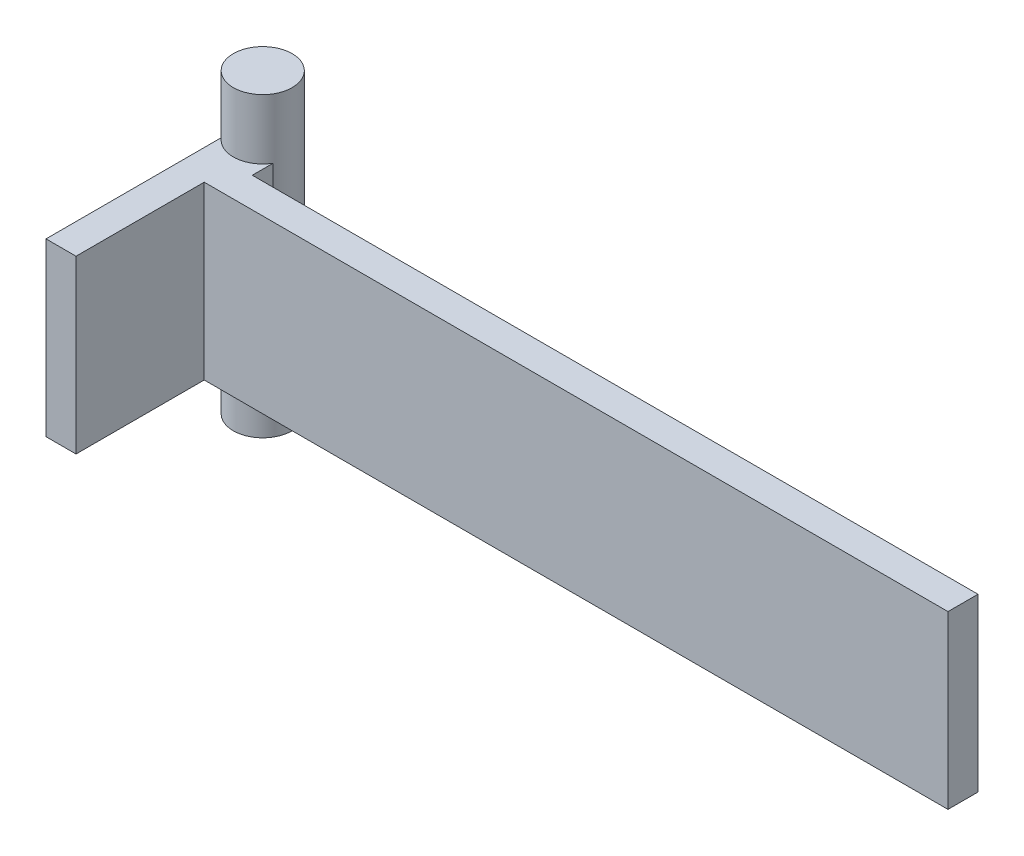
ISO-10303-21;
HEADER;
FILE_DESCRIPTION(('STEP AP214'),'2;1');
FILE_NAME('part.step','',(''),(''),'','','');
FILE_SCHEMA(('AUTOMOTIVE_DESIGN { 1 0 10303 214 1 1 1 1 }'));
ENDSEC;
DATA;
#1=APPLICATION_CONTEXT('core data for automotive mechanical design processes');
#2=APPLICATION_PROTOCOL_DEFINITION('international standard','automotive_design',2000,#1);
#3=PRODUCT_CONTEXT('',#1,'mechanical');
#4=PRODUCT('Part','Part','',(#3));
#5=PRODUCT_RELATED_PRODUCT_CATEGORY('part','',(#4));
#6=PRODUCT_DEFINITION_FORMATION('','',#4);
#7=PRODUCT_DEFINITION_CONTEXT('part definition',#1,'design');
#8=PRODUCT_DEFINITION('design','',#6,#7);
#9=PRODUCT_DEFINITION_SHAPE('','',#8);
#10=(LENGTH_UNIT() NAMED_UNIT(*) SI_UNIT(.MILLI.,.METRE.));
#11=(NAMED_UNIT(*) PLANE_ANGLE_UNIT() SI_UNIT($,.RADIAN.));
#12=(NAMED_UNIT(*) SI_UNIT($,.STERADIAN.) SOLID_ANGLE_UNIT());
#13=UNCERTAINTY_MEASURE_WITH_UNIT(LENGTH_MEASURE(1.E-05),#10,'distance_accuracy_value','');
#14=(GEOMETRIC_REPRESENTATION_CONTEXT(3) GLOBAL_UNCERTAINTY_ASSIGNED_CONTEXT((#13)) GLOBAL_UNIT_ASSIGNED_CONTEXT((#10,
#11,#12)) REPRESENTATION_CONTEXT('',''));
#15=CARTESIAN_POINT('',(0.,0.,0.));
#16=DIRECTION('',(0.,0.,1.));
#17=DIRECTION('',(1.,0.,0.));
#18=AXIS2_PLACEMENT_3D('',#15,#16,#17);
#19=CARTESIAN_POINT('',(-1.21410888509384,8.53481015756864,-5.9555332189598));
#20=DIRECTION('',(0.,-1.,0.));
#21=DIRECTION('',(1.,0.,0.));
#22=AXIS2_PLACEMENT_3D('',#19,#20,#21);
#23=CYLINDRICAL_SURFACE('',#22,4.9);
#24=CARTESIAN_POINT('',(-1.21410888509384,8.53481015756864,-5.9555332189598));
#25=DIRECTION('',(0.,-1.,0.));
#26=DIRECTION('',(1.,0.,0.));
#27=AXIS2_PLACEMENT_3D('',#24,#25,#26);
#28=CIRCLE('',#27,4.9);
#29=CARTESIAN_POINT('',(3.68589111490616,8.53481015756864,-5.9555332189598));
#30=VERTEX_POINT('',#29);
#31=EDGE_CURVE('E11',#30,#30,#28,.T.);
#32=ORIENTED_EDGE('',*,*,#31,.T.);
#33=EDGE_LOOP('',(#32));
#34=FACE_BOUND('',#33,.T.);
#35=CARTESIAN_POINT('',(-1.21410888509382,-40.9651898424314,-5.95553321895981));
#36=DIRECTION('',(0.,-1.,0.));
#37=DIRECTION('',(1.,0.,0.));
#38=AXIS2_PLACEMENT_3D('',#35,#36,#37);
#39=CIRCLE('',#38,4.9);
#40=CARTESIAN_POINT('',(3.68589111490618,-40.9651898424314,-5.95553321895981));
#41=VERTEX_POINT('',#40);
#42=EDGE_CURVE('E45',#41,#41,#39,.T.);
#43=ORIENTED_EDGE('',*,*,#42,.F.);
#44=EDGE_LOOP('',(#43));
#45=FACE_BOUND('',#44,.T.);
#46=ADVANCED_FACE('F42',(#34,#45),#23,.T.);
#47=CARTESIAN_POINT('',(-1.21410888509384,8.53481015756864,-5.9555332189598));
#48=DIRECTION('',(0.,-1.,0.));
#49=DIRECTION('',(1.,0.,0.));
#50=AXIS2_PLACEMENT_3D('',#47,#48,#49);
#51=PLANE('',#50);
#52=ORIENTED_EDGE('',*,*,#31,.F.);
#53=EDGE_LOOP('',(#52));
#54=FACE_BOUND('',#53,.T.);
#55=ADVANCED_FACE('F57',(#54),#51,.F.);
#56=CARTESIAN_POINT('',(-1.21410888509382,-40.9651898424314,-5.95553321895981));
#57=DIRECTION('',(0.,-1.,0.));
#58=DIRECTION('',(1.,0.,0.));
#59=AXIS2_PLACEMENT_3D('',#56,#57,#58);
#60=PLANE('',#59);
#61=ORIENTED_EDGE('',*,*,#42,.T.);
#62=EDGE_LOOP('',(#61));
#63=FACE_BOUND('',#62,.T.);
#64=ADVANCED_FACE('F54',(#63),#60,.T.);
#65=CLOSED_SHELL('',(#46,#55,#64));
#66=MANIFOLD_SOLID_BREP('B2',#65);
#67=CARTESIAN_POINT('',(-5.,-1.46947750329218,34.6309080849474));
#68=DIRECTION('',(0.,-1.,0.));
#69=DIRECTION('',(0.,0.,-1.));
#70=AXIS2_PLACEMENT_3D('',#67,#68,#69);
#71=PLANE('',#70);
#72=DIRECTION('',(-1.,0.,0.));
#73=VECTOR('',#72,1.);
#74=CARTESIAN_POINT('',(-5.,-1.46947750329218,-5.));
#75=LINE('',#74,#73);
#76=CARTESIAN_POINT('',(3.,-1.46947750329218,-5.));
#77=VERTEX_POINT('',#76);
#78=CARTESIAN_POINT('',(-5.,-1.46947750329218,-5.));
#79=VERTEX_POINT('',#78);
#80=EDGE_CURVE('E195',#77,#79,#75,.T.);
#81=ORIENTED_EDGE('',*,*,#80,.T.);
#82=DIRECTION('',(0.,0.,-1.));
#83=VECTOR('',#82,1.);
#84=CARTESIAN_POINT('',(-5.,-1.46947750329218,34.6309080849474));
#85=LINE('',#84,#83);
#86=CARTESIAN_POINT('',(-4.99999999999997,-1.46947750329218,26.35));
#87=VERTEX_POINT('',#86);
#88=EDGE_CURVE('E156',#87,#79,#85,.T.);
#89=ORIENTED_EDGE('',*,*,#88,.F.);
#90=DIRECTION('',(-1.,0.,0.));
#91=VECTOR('',#90,1.);
#92=CARTESIAN_POINT('',(-4.99999999999997,-1.46947750329218,26.35));
#93=LINE('',#92,#91);
#94=CARTESIAN_POINT('',(0.,-1.46947750329218,26.35));
#95=VERTEX_POINT('',#94);
#96=EDGE_CURVE('E154',#95,#87,#93,.T.);
#97=ORIENTED_EDGE('',*,*,#96,.F.);
#98=DIRECTION('',(0.,0.,-1.));
#99=VECTOR('',#98,1.);
#100=CARTESIAN_POINT('',(0.,-1.46947750329218,26.35));
#101=LINE('',#100,#99);
#102=CARTESIAN_POINT('',(0.,-1.46947750329218,5.00000000005818));
#103=VERTEX_POINT('',#102);
#104=EDGE_CURVE('E107',#95,#103,#101,.T.);
#105=ORIENTED_EDGE('',*,*,#104,.T.);
#106=DIRECTION('',(-1.,0.,0.));
#107=VECTOR('',#106,1.);
#108=CARTESIAN_POINT('',(-5.,-1.46947750329218,5.00000000005818));
#109=LINE('',#108,#107);
#110=CARTESIAN_POINT('',(123.84970239007,-1.46947750329207,5.00000000005804));
#111=VERTEX_POINT('',#110);
#112=EDGE_CURVE('E197',#111,#103,#109,.T.);
#113=ORIENTED_EDGE('',*,*,#112,.F.);
#114=DIRECTION('',(0.,0.,1.));
#115=VECTOR('',#114,1.);
#116=CARTESIAN_POINT('',(123.84970239007,-1.46947750329207,5.00000000005795));
#117=LINE('',#116,#115);
#118=CARTESIAN_POINT('',(123.84970239007,-1.46947750329207,5.79820628717333E-11));
#119=VERTEX_POINT('',#118);
#120=EDGE_CURVE('E181',#119,#111,#117,.T.);
#121=ORIENTED_EDGE('',*,*,#120,.F.);
#122=DIRECTION('',(1.,0.,0.));
#123=VECTOR('',#122,1.);
#124=CARTESIAN_POINT('',(-25.9653364201963,-1.46947750329221,5.81483909772556E-11));
#125=LINE('',#124,#123);
#126=CARTESIAN_POINT('',(3.,-1.46947750329218,5.8043847506184E-11));
#127=VERTEX_POINT('',#126);
#128=EDGE_CURVE('E184',#127,#119,#125,.T.);
#129=ORIENTED_EDGE('',*,*,#128,.F.);
#130=DIRECTION('',(0.,0.,-1.));
#131=VECTOR('',#130,1.);
#132=CARTESIAN_POINT('',(3.,-1.46947750329218,34.6309080849474));
#133=LINE('',#132,#131);
#134=EDGE_CURVE('E200',#127,#77,#133,.T.);
#135=ORIENTED_EDGE('',*,*,#134,.T.);
#136=EDGE_LOOP('',(#81,#89,#97,#105,#113,#121,#129,#135));
#137=FACE_BOUND('',#136,.T.);
#138=ADVANCED_FACE('F84',(#137),#71,.F.);
#139=CARTESIAN_POINT('',(3.,-1.46947750329218,34.6309080849474));
#140=DIRECTION('',(-1.,0.,0.));
#141=DIRECTION('',(0.,-1.,0.));
#142=AXIS2_PLACEMENT_3D('',#139,#140,#141);
#143=PLANE('',#142);
#144=ORIENTED_EDGE('',*,*,#134,.F.);
#145=DIRECTION('',(0.,1.,0.));
#146=VECTOR('',#145,1.);
#147=CARTESIAN_POINT('',(3.,0.,0.));
#148=LINE('',#147,#146);
#149=CARTESIAN_POINT('',(3.,-30.,0.));
#150=VERTEX_POINT('',#149);
#151=EDGE_CURVE('E40',#150,#127,#148,.T.);
#152=ORIENTED_EDGE('',*,*,#151,.F.);
#153=DIRECTION('',(0.,0.,-1.));
#154=VECTOR('',#153,1.);
#155=CARTESIAN_POINT('',(3.,-30.,34.6309080849474));
#156=LINE('',#155,#154);
#157=CARTESIAN_POINT('',(3.,-30.,-5.));
#158=VERTEX_POINT('',#157);
#159=EDGE_CURVE('E203',#150,#158,#156,.T.);
#160=ORIENTED_EDGE('',*,*,#159,.T.);
#161=DIRECTION('',(0.,1.,0.));
#162=VECTOR('',#161,1.);
#163=CARTESIAN_POINT('',(3.,-1.46947750329218,-5.));
#164=LINE('',#163,#162);
#165=EDGE_CURVE('E192',#158,#77,#164,.T.);
#166=ORIENTED_EDGE('',*,*,#165,.T.);
#167=EDGE_LOOP('',(#144,#152,#160,#166));
#168=FACE_BOUND('',#167,.T.);
#169=ADVANCED_FACE('F221',(#168),#143,.F.);
#170=CARTESIAN_POINT('',(0.,0.,0.));
#171=DIRECTION('',(0.,0.,-1.));
#172=DIRECTION('',(-1.,0.,0.));
#173=AXIS2_PLACEMENT_3D('',#170,#171,#172);
#174=PLANE('',#173);
#175=ORIENTED_EDGE('',*,*,#151,.T.);
#176=ORIENTED_EDGE('',*,*,#128,.T.);
#177=DIRECTION('',(0.,1.,0.));
#178=VECTOR('',#177,1.);
#179=CARTESIAN_POINT('',(123.84970239007,-29.9999999999999,5.79812372950729E-11));
#180=LINE('',#179,#178);
#181=CARTESIAN_POINT('',(123.84970239007,-29.9999999999999,5.79812372950729E-11));
#182=VERTEX_POINT('',#181);
#183=EDGE_CURVE('E172',#182,#119,#180,.T.);
#184=ORIENTED_EDGE('',*,*,#183,.F.);
#185=DIRECTION('',(1.,0.,0.));
#186=VECTOR('',#185,1.);
#187=CARTESIAN_POINT('',(10.,-30.,0.));
#188=LINE('',#187,#186);
#189=EDGE_CURVE('E199',#150,#182,#188,.T.);
#190=ORIENTED_EDGE('',*,*,#189,.F.);
#191=EDGE_LOOP('',(#175,#176,#184,#190));
#192=FACE_BOUND('',#191,.T.);
#193=ADVANCED_FACE('F217',(#192),#174,.T.);
#194=CARTESIAN_POINT('',(10.,-30.,5.));
#195=DIRECTION('',(0.,1.,0.));
#196=DIRECTION('',(-1.,0.,0.));
#197=AXIS2_PLACEMENT_3D('',#194,#195,#196);
#198=PLANE('',#197);
#199=DIRECTION('',(1.,0.,0.));
#200=VECTOR('',#199,1.);
#201=CARTESIAN_POINT('',(10.,-30.,5.));
#202=LINE('',#201,#200);
#203=CARTESIAN_POINT('',(0.,-30.,5.));
#204=VERTEX_POINT('',#203);
#205=CARTESIAN_POINT('',(123.84970239007,-29.9999999999999,5.00000000005804));
#206=VERTEX_POINT('',#205);
#207=EDGE_CURVE('E92',#204,#206,#202,.T.);
#208=ORIENTED_EDGE('',*,*,#207,.F.);
#209=DIRECTION('',(0.,0.,-1.));
#210=VECTOR('',#209,1.);
#211=CARTESIAN_POINT('',(0.,-30.,26.35));
#212=LINE('',#211,#210);
#213=CARTESIAN_POINT('',(0.,-30.,26.35));
#214=VERTEX_POINT('',#213);
#215=EDGE_CURVE('E151',#214,#204,#212,.T.);
#216=ORIENTED_EDGE('',*,*,#215,.F.);
#217=DIRECTION('',(-1.,0.,0.));
#218=VECTOR('',#217,1.);
#219=CARTESIAN_POINT('',(0.,-30.,26.35));
#220=LINE('',#219,#218);
#221=CARTESIAN_POINT('',(-4.99999999999997,-30.,26.35));
#222=VERTEX_POINT('',#221);
#223=EDGE_CURVE('E160',#214,#222,#220,.T.);
#224=ORIENTED_EDGE('',*,*,#223,.T.);
#225=DIRECTION('',(0.,0.,-1.));
#226=VECTOR('',#225,1.);
#227=CARTESIAN_POINT('',(-5.,-30.,34.6309080849474));
#228=LINE('',#227,#226);
#229=CARTESIAN_POINT('',(-5.,-30.,-5.));
#230=VERTEX_POINT('',#229);
#231=EDGE_CURVE('E201',#222,#230,#228,.T.);
#232=ORIENTED_EDGE('',*,*,#231,.T.);
#233=DIRECTION('',(1.,0.,0.));
#234=VECTOR('',#233,1.);
#235=CARTESIAN_POINT('',(-5.,-30.,-5.));
#236=LINE('',#235,#234);
#237=EDGE_CURVE('E189',#230,#158,#236,.T.);
#238=ORIENTED_EDGE('',*,*,#237,.T.);
#239=ORIENTED_EDGE('',*,*,#159,.F.);
#240=ORIENTED_EDGE('',*,*,#189,.T.);
#241=DIRECTION('',(0.,0.,-1.));
#242=VECTOR('',#241,1.);
#243=CARTESIAN_POINT('',(123.84970239007,-29.9999999999999,5.00000000005795));
#244=LINE('',#243,#242);
#245=EDGE_CURVE('E175',#206,#182,#244,.T.);
#246=ORIENTED_EDGE('',*,*,#245,.F.);
#247=EDGE_LOOP('',(#208,#216,#224,#232,#238,#239,#240,#246));
#248=FACE_BOUND('',#247,.T.);
#249=ADVANCED_FACE('F86',(#248),#198,.F.);
#250=CARTESIAN_POINT('',(0.,0.,5.));
#251=DIRECTION('',(0.,0.,-1.));
#252=DIRECTION('',(-1.,0.,0.));
#253=AXIS2_PLACEMENT_3D('',#250,#251,#252);
#254=PLANE('',#253);
#255=ORIENTED_EDGE('',*,*,#112,.T.);
#256=DIRECTION('',(0.,-1.,0.));
#257=VECTOR('',#256,1.);
#258=CARTESIAN_POINT('',(0.,0.,5.));
#259=LINE('',#258,#257);
#260=EDGE_CURVE('E99',#103,#204,#259,.T.);
#261=ORIENTED_EDGE('',*,*,#260,.T.);
#262=ORIENTED_EDGE('',*,*,#207,.T.);
#263=DIRECTION('',(0.,-1.,0.));
#264=VECTOR('',#263,1.);
#265=CARTESIAN_POINT('',(123.84970239007,-29.9999999999999,5.00000000005798));
#266=LINE('',#265,#264);
#267=EDGE_CURVE('E178',#111,#206,#266,.T.);
#268=ORIENTED_EDGE('',*,*,#267,.F.);
#269=EDGE_LOOP('',(#255,#261,#262,#268));
#270=FACE_BOUND('',#269,.T.);
#271=ADVANCED_FACE('F230',(#270),#254,.F.);
#272=CARTESIAN_POINT('',(-5.,-1.46947750329218,34.6309080849474));
#273=DIRECTION('',(1.,0.,0.));
#274=DIRECTION('',(0.,1.,0.));
#275=AXIS2_PLACEMENT_3D('',#272,#273,#274);
#276=PLANE('',#275);
#277=DIRECTION('',(0.,1.,0.));
#278=VECTOR('',#277,1.);
#279=CARTESIAN_POINT('',(-4.99999999999997,-30.,26.35));
#280=LINE('',#279,#278);
#281=EDGE_CURVE('E165',#222,#87,#280,.T.);
#282=ORIENTED_EDGE('',*,*,#281,.T.);
#283=ORIENTED_EDGE('',*,*,#88,.T.);
#284=DIRECTION('',(0.,-1.,0.));
#285=VECTOR('',#284,1.);
#286=CARTESIAN_POINT('',(-5.,-1.46947750329218,-5.));
#287=LINE('',#286,#285);
#288=EDGE_CURVE('E186',#79,#230,#287,.T.);
#289=ORIENTED_EDGE('',*,*,#288,.T.);
#290=ORIENTED_EDGE('',*,*,#231,.F.);
#291=EDGE_LOOP('',(#282,#283,#289,#290));
#292=FACE_BOUND('',#291,.T.);
#293=ADVANCED_FACE('F229',(#292),#276,.F.);
#294=CARTESIAN_POINT('',(0.,0.,-5.));
#295=DIRECTION('',(0.,0.,1.));
#296=DIRECTION('',(1.,0.,0.));
#297=AXIS2_PLACEMENT_3D('',#294,#295,#296);
#298=PLANE('',#297);
#299=ORIENTED_EDGE('',*,*,#288,.F.);
#300=ORIENTED_EDGE('',*,*,#80,.F.);
#301=ORIENTED_EDGE('',*,*,#165,.F.);
#302=ORIENTED_EDGE('',*,*,#237,.F.);
#303=EDGE_LOOP('',(#299,#300,#301,#302));
#304=FACE_BOUND('',#303,.T.);
#305=ADVANCED_FACE('F227',(#304),#298,.F.);
#306=CARTESIAN_POINT('',(123.84970239007,-30.,6.00000000005796));
#307=DIRECTION('',(-1.,0.,0.));
#308=DIRECTION('',(0.,-1.,0.));
#309=AXIS2_PLACEMENT_3D('',#306,#307,#308);
#310=PLANE('',#309);
#311=ORIENTED_EDGE('',*,*,#267,.T.);
#312=ORIENTED_EDGE('',*,*,#245,.T.);
#313=ORIENTED_EDGE('',*,*,#183,.T.);
#314=ORIENTED_EDGE('',*,*,#120,.T.);
#315=EDGE_LOOP('',(#311,#312,#313,#314));
#316=FACE_BOUND('',#315,.T.);
#317=ADVANCED_FACE('F214',(#316),#310,.F.);
#318=CARTESIAN_POINT('',(0.,-30.,26.35));
#319=DIRECTION('',(1.,0.,0.));
#320=DIRECTION('',(0.,0.,-1.));
#321=AXIS2_PLACEMENT_3D('',#318,#319,#320);
#322=PLANE('',#321);
#323=ORIENTED_EDGE('',*,*,#104,.F.);
#324=DIRECTION('',(0.,-1.,0.));
#325=VECTOR('',#324,1.);
#326=CARTESIAN_POINT('',(0.,-30.,26.35));
#327=LINE('',#326,#325);
#328=EDGE_CURVE('E149',#95,#214,#327,.T.);
#329=ORIENTED_EDGE('',*,*,#328,.T.);
#330=ORIENTED_EDGE('',*,*,#215,.T.);
#331=ORIENTED_EDGE('',*,*,#260,.F.);
#332=EDGE_LOOP('',(#323,#329,#330,#331));
#333=FACE_BOUND('',#332,.T.);
#334=ADVANCED_FACE('F146',(#333),#322,.T.);
#335=CARTESIAN_POINT('',(0.,0.,26.35));
#336=DIRECTION('',(0.,0.,-1.));
#337=DIRECTION('',(-1.,0.,0.));
#338=AXIS2_PLACEMENT_3D('',#335,#336,#337);
#339=PLANE('',#338);
#340=ORIENTED_EDGE('',*,*,#328,.F.);
#341=ORIENTED_EDGE('',*,*,#96,.T.);
#342=ORIENTED_EDGE('',*,*,#281,.F.);
#343=ORIENTED_EDGE('',*,*,#223,.F.);
#344=EDGE_LOOP('',(#340,#341,#342,#343));
#345=FACE_BOUND('',#344,.T.);
#346=ADVANCED_FACE('F163',(#345),#339,.F.);
#347=CLOSED_SHELL('',(#138,#169,#193,#249,#271,#293,#305,#317,#334,#346));
#348=MANIFOLD_SOLID_BREP('B6',#347);
#349=ADVANCED_BREP_SHAPE_REPRESENTATION('',(#18,#66,#348),#14);
#350=SHAPE_DEFINITION_REPRESENTATION(#9,#349);
ENDSEC;
END-ISO-10303-21;
